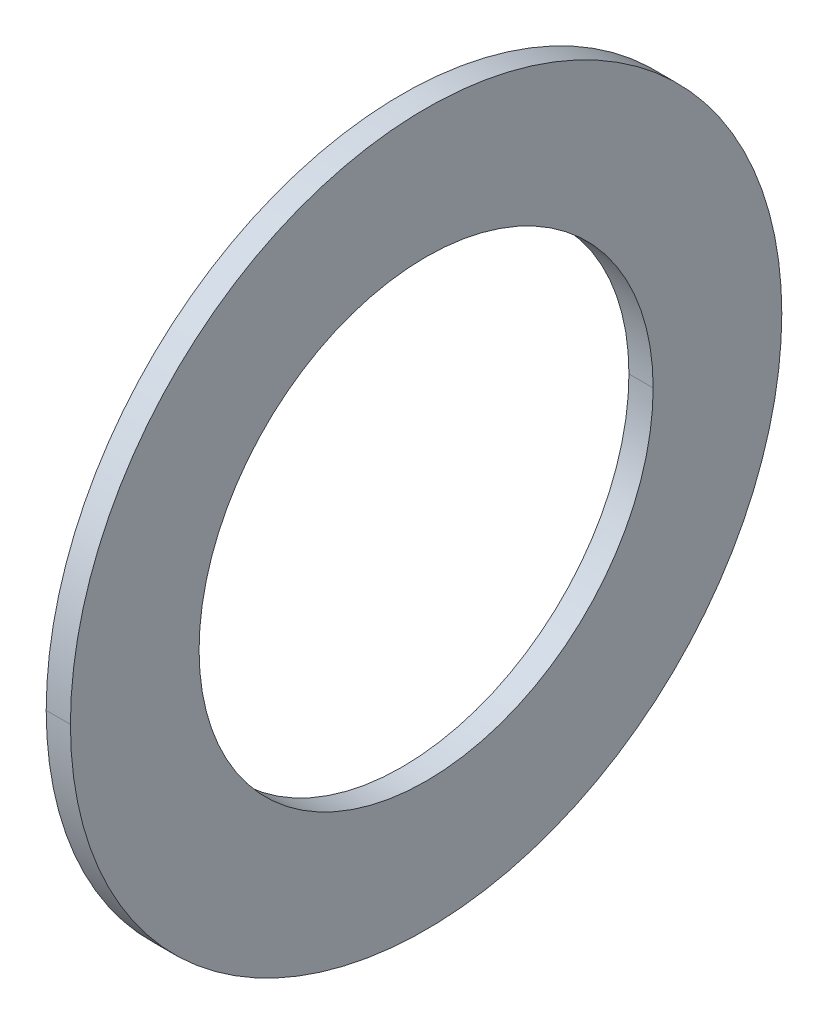
ISO-10303-21;
HEADER;
FILE_DESCRIPTION(('STEP AP214'),'2;1');
FILE_NAME('part.step','',(''),(''),'','','');
FILE_SCHEMA(('AUTOMOTIVE_DESIGN { 1 0 10303 214 1 1 1 1 }'));
ENDSEC;
DATA;
#1=APPLICATION_CONTEXT('core data for automotive mechanical design processes');
#2=APPLICATION_PROTOCOL_DEFINITION('international standard','automotive_design',2000,#1);
#3=PRODUCT_CONTEXT('',#1,'mechanical');
#4=PRODUCT('Part','Part','',(#3));
#5=PRODUCT_RELATED_PRODUCT_CATEGORY('part','',(#4));
#6=PRODUCT_DEFINITION_FORMATION('','',#4);
#7=PRODUCT_DEFINITION_CONTEXT('part definition',#1,'design');
#8=PRODUCT_DEFINITION('design','',#6,#7);
#9=PRODUCT_DEFINITION_SHAPE('','',#8);
#10=(LENGTH_UNIT() NAMED_UNIT(*) SI_UNIT(.MILLI.,.METRE.));
#11=(NAMED_UNIT(*) PLANE_ANGLE_UNIT() SI_UNIT($,.RADIAN.));
#12=(NAMED_UNIT(*) SI_UNIT($,.STERADIAN.) SOLID_ANGLE_UNIT());
#13=UNCERTAINTY_MEASURE_WITH_UNIT(LENGTH_MEASURE(1.E-05),#10,'distance_accuracy_value','');
#14=(GEOMETRIC_REPRESENTATION_CONTEXT(3) GLOBAL_UNCERTAINTY_ASSIGNED_CONTEXT((#13)) GLOBAL_UNIT_ASSIGNED_CONTEXT((#10,
#11,#12)) REPRESENTATION_CONTEXT('',''));
#15=CARTESIAN_POINT('',(0.,0.,0.));
#16=DIRECTION('',(0.,0.,1.));
#17=DIRECTION('',(1.,0.,0.));
#18=AXIS2_PLACEMENT_3D('',#15,#16,#17);
#19=CARTESIAN_POINT('',(0.8,0.,0.));
#20=DIRECTION('',(-1.,0.,0.));
#21=DIRECTION('',(0.,1.,0.));
#22=AXIS2_PLACEMENT_3D('',#19,#20,#21);
#23=CYLINDRICAL_SURFACE('',#22,15.);
#24=DIRECTION('',(-1.,0.,0.));
#25=VECTOR('',#24,1.);
#26=CARTESIAN_POINT('',(0.8,0.,-15.));
#27=LINE('',#26,#25);
#28=CARTESIAN_POINT('',(0.8,0.,-15.));
#29=VERTEX_POINT('',#28);
#30=CARTESIAN_POINT('',(-0.8,0.,-15.));
#31=VERTEX_POINT('',#30);
#32=EDGE_CURVE('E10',#29,#31,#27,.T.);
#33=ORIENTED_EDGE('',*,*,#32,.T.);
#34=CARTESIAN_POINT('',(-0.8,0.,0.));
#35=DIRECTION('',(1.,0.,0.));
#36=DIRECTION('',(0.,0.,-1.));
#37=AXIS2_PLACEMENT_3D('',#34,#35,#36);
#38=CIRCLE('',#37,15.);
#39=CARTESIAN_POINT('',(-0.8,0.,15.));
#40=VERTEX_POINT('',#39);
#41=EDGE_CURVE('E24',#40,#31,#38,.T.);
#42=ORIENTED_EDGE('',*,*,#41,.F.);
#43=DIRECTION('',(-1.,0.,0.));
#44=VECTOR('',#43,1.);
#45=CARTESIAN_POINT('',(0.8,0.,15.));
#46=LINE('',#45,#44);
#47=CARTESIAN_POINT('',(0.8,0.,15.));
#48=VERTEX_POINT('',#47);
#49=EDGE_CURVE('E93',#48,#40,#46,.T.);
#50=ORIENTED_EDGE('',*,*,#49,.F.);
#51=CARTESIAN_POINT('',(0.8,0.,0.));
#52=DIRECTION('',(1.,0.,0.));
#53=DIRECTION('',(0.,0.,-1.));
#54=AXIS2_PLACEMENT_3D('',#51,#52,#53);
#55=CIRCLE('',#54,15.);
#56=EDGE_CURVE('E89',#48,#29,#55,.T.);
#57=ORIENTED_EDGE('',*,*,#56,.T.);
#58=EDGE_LOOP('',(#33,#42,#50,#57));
#59=FACE_BOUND('',#58,.T.);
#60=ADVANCED_FACE('F16',(#59),#23,.F.);
#61=CARTESIAN_POINT('',(0.8,0.,0.));
#62=DIRECTION('',(1.,0.,0.));
#63=DIRECTION('',(0.,0.,-1.));
#64=AXIS2_PLACEMENT_3D('',#61,#62,#63);
#65=PLANE('',#64);
#66=ORIENTED_EDGE('',*,*,#56,.F.);
#67=CARTESIAN_POINT('',(0.8,0.,0.));
#68=DIRECTION('',(1.,0.,0.));
#69=DIRECTION('',(0.,0.,-1.));
#70=AXIS2_PLACEMENT_3D('',#67,#68,#69);
#71=CIRCLE('',#70,15.);
#72=EDGE_CURVE('E84',#29,#48,#71,.T.);
#73=ORIENTED_EDGE('',*,*,#72,.F.);
#74=EDGE_LOOP('',(#66,#73));
#75=FACE_BOUND('',#74,.T.);
#76=CARTESIAN_POINT('',(0.8,0.,0.));
#77=DIRECTION('',(1.,0.,0.));
#78=DIRECTION('',(0.,0.,-1.));
#79=AXIS2_PLACEMENT_3D('',#76,#77,#78);
#80=CIRCLE('',#79,23.5);
#81=CARTESIAN_POINT('',(0.8,0.,-23.5));
#82=VERTEX_POINT('',#81);
#83=CARTESIAN_POINT('',(0.8,0.,23.5));
#84=VERTEX_POINT('',#83);
#85=EDGE_CURVE('E71',#82,#84,#80,.T.);
#86=ORIENTED_EDGE('',*,*,#85,.T.);
#87=CARTESIAN_POINT('',(0.8,0.,0.));
#88=DIRECTION('',(1.,0.,0.));
#89=DIRECTION('',(0.,0.,-1.));
#90=AXIS2_PLACEMENT_3D('',#87,#88,#89);
#91=CIRCLE('',#90,23.5);
#92=EDGE_CURVE('E72',#84,#82,#91,.T.);
#93=ORIENTED_EDGE('',*,*,#92,.T.);
#94=EDGE_LOOP('',(#86,#93));
#95=FACE_BOUND('',#94,.T.);
#96=ADVANCED_FACE('F115',(#75,#95),#65,.T.);
#97=CARTESIAN_POINT('',(0.8,0.,0.));
#98=DIRECTION('',(-1.,0.,0.));
#99=DIRECTION('',(0.,1.,0.));
#100=AXIS2_PLACEMENT_3D('',#97,#98,#99);
#101=CYLINDRICAL_SURFACE('',#100,23.5);
#102=DIRECTION('',(-1.,0.,0.));
#103=VECTOR('',#102,1.);
#104=CARTESIAN_POINT('',(0.8,0.,-23.5));
#105=LINE('',#104,#103);
#106=CARTESIAN_POINT('',(-0.8,0.,-23.5));
#107=VERTEX_POINT('',#106);
#108=EDGE_CURVE('E58',#82,#107,#105,.T.);
#109=ORIENTED_EDGE('',*,*,#108,.F.);
#110=ORIENTED_EDGE('',*,*,#92,.F.);
#111=DIRECTION('',(-1.,0.,0.));
#112=VECTOR('',#111,1.);
#113=CARTESIAN_POINT('',(0.8,0.,23.5));
#114=LINE('',#113,#112);
#115=CARTESIAN_POINT('',(-0.8,0.,23.5));
#116=VERTEX_POINT('',#115);
#117=EDGE_CURVE('E60',#84,#116,#114,.T.);
#118=ORIENTED_EDGE('',*,*,#117,.T.);
#119=CARTESIAN_POINT('',(-0.8,0.,0.));
#120=DIRECTION('',(1.,0.,0.));
#121=DIRECTION('',(0.,0.,-1.));
#122=AXIS2_PLACEMENT_3D('',#119,#120,#121);
#123=CIRCLE('',#122,23.5);
#124=EDGE_CURVE('E53',#116,#107,#123,.T.);
#125=ORIENTED_EDGE('',*,*,#124,.T.);
#126=EDGE_LOOP('',(#109,#110,#118,#125));
#127=FACE_BOUND('',#126,.T.);
#128=ADVANCED_FACE('F55',(#127),#101,.T.);
#129=CARTESIAN_POINT('',(-0.8,0.,0.));
#130=DIRECTION('',(1.,0.,0.));
#131=DIRECTION('',(0.,0.,-1.));
#132=AXIS2_PLACEMENT_3D('',#129,#130,#131);
#133=PLANE('',#132);
#134=CARTESIAN_POINT('',(-0.8,0.,0.));
#135=DIRECTION('',(1.,0.,0.));
#136=DIRECTION('',(0.,0.,-1.));
#137=AXIS2_PLACEMENT_3D('',#134,#135,#136);
#138=CIRCLE('',#137,15.);
#139=EDGE_CURVE('E63',#31,#40,#138,.T.);
#140=ORIENTED_EDGE('',*,*,#139,.T.);
#141=ORIENTED_EDGE('',*,*,#41,.T.);
#142=EDGE_LOOP('',(#140,#141));
#143=FACE_BOUND('',#142,.T.);
#144=ORIENTED_EDGE('',*,*,#124,.F.);
#145=CARTESIAN_POINT('',(-0.8,0.,0.));
#146=DIRECTION('',(1.,0.,0.));
#147=DIRECTION('',(0.,0.,-1.));
#148=AXIS2_PLACEMENT_3D('',#145,#146,#147);
#149=CIRCLE('',#148,23.5);
#150=EDGE_CURVE('E65',#107,#116,#149,.T.);
#151=ORIENTED_EDGE('',*,*,#150,.F.);
#152=EDGE_LOOP('',(#144,#151));
#153=FACE_BOUND('',#152,.T.);
#154=ADVANCED_FACE('F66',(#143,#153),#133,.F.);
#155=CARTESIAN_POINT('',(0.8,0.,0.));
#156=DIRECTION('',(-1.,0.,0.));
#157=DIRECTION('',(0.,-1.,0.));
#158=AXIS2_PLACEMENT_3D('',#155,#156,#157);
#159=CYLINDRICAL_SURFACE('',#158,23.5);
#160=ORIENTED_EDGE('',*,*,#108,.T.);
#161=ORIENTED_EDGE('',*,*,#150,.T.);
#162=ORIENTED_EDGE('',*,*,#117,.F.);
#163=ORIENTED_EDGE('',*,*,#85,.F.);
#164=EDGE_LOOP('',(#160,#161,#162,#163));
#165=FACE_BOUND('',#164,.T.);
#166=ADVANCED_FACE('F70',(#165),#159,.T.);
#167=CARTESIAN_POINT('',(0.8,0.,0.));
#168=DIRECTION('',(-1.,0.,0.));
#169=DIRECTION('',(0.,-1.,0.));
#170=AXIS2_PLACEMENT_3D('',#167,#168,#169);
#171=CYLINDRICAL_SURFACE('',#170,15.);
#172=ORIENTED_EDGE('',*,*,#32,.F.);
#173=ORIENTED_EDGE('',*,*,#72,.T.);
#174=ORIENTED_EDGE('',*,*,#49,.T.);
#175=ORIENTED_EDGE('',*,*,#139,.F.);
#176=EDGE_LOOP('',(#172,#173,#174,#175));
#177=FACE_BOUND('',#176,.T.);
#178=ADVANCED_FACE('F111',(#177),#171,.F.);
#179=CLOSED_SHELL('',(#60,#96,#128,#154,#166,#178));
#180=MANIFOLD_SOLID_BREP('B1',#179);
#181=ADVANCED_BREP_SHAPE_REPRESENTATION('',(#18,#180),#14);
#182=SHAPE_DEFINITION_REPRESENTATION(#9,#181);
ENDSEC;
END-ISO-10303-21;
